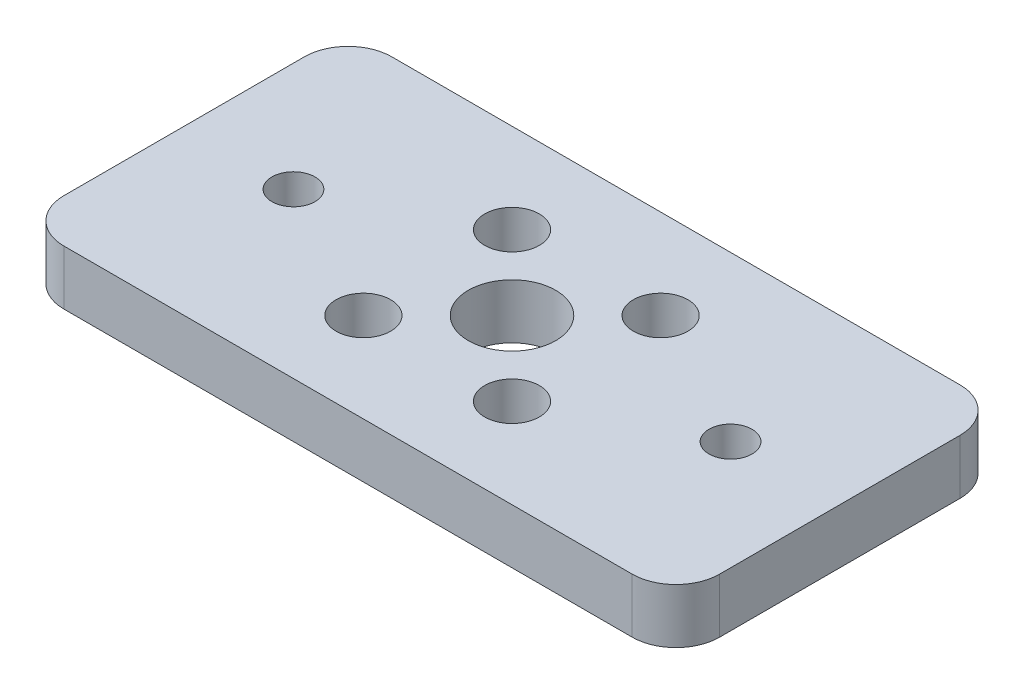
ISO-10303-21;
HEADER;
FILE_DESCRIPTION(('STEP AP214'),'2;1');
FILE_NAME('part.step','',(''),(''),'','','');
FILE_SCHEMA(('AUTOMOTIVE_DESIGN { 1 0 10303 214 1 1 1 1 }'));
ENDSEC;
DATA;
#1=APPLICATION_CONTEXT('core data for automotive mechanical design processes');
#2=APPLICATION_PROTOCOL_DEFINITION('international standard','automotive_design',2000,#1);
#3=PRODUCT_CONTEXT('',#1,'mechanical');
#4=PRODUCT('Part','Part','',(#3));
#5=PRODUCT_RELATED_PRODUCT_CATEGORY('part','',(#4));
#6=PRODUCT_DEFINITION_FORMATION('','',#4);
#7=PRODUCT_DEFINITION_CONTEXT('part definition',#1,'design');
#8=PRODUCT_DEFINITION('design','',#6,#7);
#9=PRODUCT_DEFINITION_SHAPE('','',#8);
#10=(LENGTH_UNIT() NAMED_UNIT(*) SI_UNIT(.MILLI.,.METRE.));
#11=(NAMED_UNIT(*) PLANE_ANGLE_UNIT() SI_UNIT($,.RADIAN.));
#12=(NAMED_UNIT(*) SI_UNIT($,.STERADIAN.) SOLID_ANGLE_UNIT());
#13=UNCERTAINTY_MEASURE_WITH_UNIT(LENGTH_MEASURE(1.E-05),#10,'distance_accuracy_value','');
#14=(GEOMETRIC_REPRESENTATION_CONTEXT(3) GLOBAL_UNCERTAINTY_ASSIGNED_CONTEXT((#13)) GLOBAL_UNIT_ASSIGNED_CONTEXT((#10,
#11,#12)) REPRESENTATION_CONTEXT('',''));
#15=CARTESIAN_POINT('',(0.,0.,0.));
#16=DIRECTION('',(0.,0.,1.));
#17=DIRECTION('',(1.,0.,0.));
#18=AXIS2_PLACEMENT_3D('',#15,#16,#17);
#19=CARTESIAN_POINT('',(0.,3.175,0.));
#20=DIRECTION('',(0.,-1.,0.));
#21=DIRECTION('',(0.,0.,-1.));
#22=AXIS2_PLACEMENT_3D('',#19,#20,#21);
#23=PLANE('',#22);
#24=CARTESIAN_POINT('',(-12.7,3.175,0.));
#25=DIRECTION('',(0.,1.,0.));
#26=DIRECTION('',(0.,0.,1.));
#27=AXIS2_PLACEMENT_3D('',#24,#25,#26);
#28=CIRCLE('',#27,1.24999999999999);
#29=CARTESIAN_POINT('',(-12.7,3.175,1.24999999999999));
#30=VERTEX_POINT('',#29);
#31=EDGE_CURVE('E251',#30,#30,#28,.T.);
#32=ORIENTED_EDGE('',*,*,#31,.F.);
#33=EDGE_LOOP('',(#32));
#34=FACE_BOUND('',#33,.T.);
#35=CARTESIAN_POINT('',(12.7,3.175,0.));
#36=DIRECTION('',(0.,1.,0.));
#37=DIRECTION('',(0.,0.,1.));
#38=AXIS2_PLACEMENT_3D('',#35,#36,#37);
#39=CIRCLE('',#38,1.24999999999999);
#40=CARTESIAN_POINT('',(12.7,3.175,1.24999999999998));
#41=VERTEX_POINT('',#40);
#42=EDGE_CURVE('E243',#41,#41,#39,.T.);
#43=ORIENTED_EDGE('',*,*,#42,.F.);
#44=EDGE_LOOP('',(#43));
#45=FACE_BOUND('',#44,.T.);
#46=CARTESIAN_POINT('',(4.318,3.175,-4.318));
#47=DIRECTION('',(0.,1.,0.));
#48=DIRECTION('',(0.,0.,1.));
#49=AXIS2_PLACEMENT_3D('',#46,#47,#48);
#50=CIRCLE('',#49,1.5875);
#51=CARTESIAN_POINT('',(4.318,3.175,-2.7305));
#52=VERTEX_POINT('',#51);
#53=EDGE_CURVE('E212',#52,#52,#50,.T.);
#54=ORIENTED_EDGE('',*,*,#53,.F.);
#55=EDGE_LOOP('',(#54));
#56=FACE_BOUND('',#55,.T.);
#57=CARTESIAN_POINT('',(-4.318,3.175,4.318));
#58=DIRECTION('',(0.,1.,0.));
#59=DIRECTION('',(0.,0.,1.));
#60=AXIS2_PLACEMENT_3D('',#57,#58,#59);
#61=CIRCLE('',#60,1.5875);
#62=CARTESIAN_POINT('',(-4.318,3.175,5.9055));
#63=VERTEX_POINT('',#62);
#64=EDGE_CURVE('E220',#63,#63,#61,.T.);
#65=ORIENTED_EDGE('',*,*,#64,.F.);
#66=EDGE_LOOP('',(#65));
#67=FACE_BOUND('',#66,.T.);
#68=CARTESIAN_POINT('',(4.318,3.175,4.318));
#69=DIRECTION('',(0.,1.,0.));
#70=DIRECTION('',(0.,0.,1.));
#71=AXIS2_PLACEMENT_3D('',#68,#69,#70);
#72=CIRCLE('',#71,1.5875);
#73=CARTESIAN_POINT('',(4.318,3.175,5.9055));
#74=VERTEX_POINT('',#73);
#75=EDGE_CURVE('E221',#74,#74,#72,.T.);
#76=ORIENTED_EDGE('',*,*,#75,.F.);
#77=EDGE_LOOP('',(#76));
#78=FACE_BOUND('',#77,.T.);
#79=CARTESIAN_POINT('',(-4.318,3.175,-4.318));
#80=DIRECTION('',(0.,1.,0.));
#81=DIRECTION('',(0.,0.,1.));
#82=AXIS2_PLACEMENT_3D('',#79,#80,#81);
#83=CIRCLE('',#82,1.5875);
#84=CARTESIAN_POINT('',(-4.318,3.175,-2.7305));
#85=VERTEX_POINT('',#84);
#86=EDGE_CURVE('E208',#85,#85,#83,.T.);
#87=ORIENTED_EDGE('',*,*,#86,.F.);
#88=EDGE_LOOP('',(#87));
#89=FACE_BOUND('',#88,.T.);
#90=DIRECTION('',(0.,0.,-1.));
#91=VECTOR('',#90,1.);
#92=CARTESIAN_POINT('',(19.05,3.175,9.525));
#93=LINE('',#92,#91);
#94=CARTESIAN_POINT('',(19.05,3.175,6.985));
#95=VERTEX_POINT('',#94);
#96=CARTESIAN_POINT('',(19.05,3.175,-6.98499999999999));
#97=VERTEX_POINT('',#96);
#98=EDGE_CURVE('E155',#95,#97,#93,.T.);
#99=ORIENTED_EDGE('',*,*,#98,.T.);
#100=CARTESIAN_POINT('',(16.51,3.175,-6.985));
#101=DIRECTION('',(0.,-1.,0.));
#102=DIRECTION('',(0.,0.,-1.));
#103=AXIS2_PLACEMENT_3D('',#100,#101,#102);
#104=CIRCLE('',#103,2.54);
#105=CARTESIAN_POINT('',(16.51,3.175,-9.525));
#106=VERTEX_POINT('',#105);
#107=EDGE_CURVE('E179',#97,#106,#104,.F.);
#108=ORIENTED_EDGE('',*,*,#107,.T.);
#109=DIRECTION('',(-1.,0.,0.));
#110=VECTOR('',#109,1.);
#111=CARTESIAN_POINT('',(-19.05,3.175,-9.525));
#112=LINE('',#111,#110);
#113=CARTESIAN_POINT('',(-16.51,3.175,-9.525));
#114=VERTEX_POINT('',#113);
#115=EDGE_CURVE('E132',#106,#114,#112,.T.);
#116=ORIENTED_EDGE('',*,*,#115,.T.);
#117=CARTESIAN_POINT('',(-16.51,3.175,-6.985));
#118=DIRECTION('',(0.,-1.,0.));
#119=DIRECTION('',(0.,0.,-1.));
#120=AXIS2_PLACEMENT_3D('',#117,#118,#119);
#121=CIRCLE('',#120,2.54);
#122=CARTESIAN_POINT('',(-19.05,3.175,-6.98499999999999));
#123=VERTEX_POINT('',#122);
#124=EDGE_CURVE('E176',#114,#123,#121,.F.);
#125=ORIENTED_EDGE('',*,*,#124,.T.);
#126=DIRECTION('',(0.,0.,1.));
#127=VECTOR('',#126,1.);
#128=CARTESIAN_POINT('',(-19.05,3.175,9.525));
#129=LINE('',#128,#127);
#130=CARTESIAN_POINT('',(-19.05,3.175,6.985));
#131=VERTEX_POINT('',#130);
#132=EDGE_CURVE('E191',#123,#131,#129,.T.);
#133=ORIENTED_EDGE('',*,*,#132,.T.);
#134=CARTESIAN_POINT('',(-16.51,3.175,6.985));
#135=DIRECTION('',(0.,-1.,0.));
#136=DIRECTION('',(0.,0.,-1.));
#137=AXIS2_PLACEMENT_3D('',#134,#135,#136);
#138=CIRCLE('',#137,2.54);
#139=CARTESIAN_POINT('',(-16.51,3.175,9.525));
#140=VERTEX_POINT('',#139);
#141=EDGE_CURVE('E66',#131,#140,#138,.F.);
#142=ORIENTED_EDGE('',*,*,#141,.T.);
#143=DIRECTION('',(1.,0.,0.));
#144=VECTOR('',#143,1.);
#145=CARTESIAN_POINT('',(-19.05,3.175,9.525));
#146=LINE('',#145,#144);
#147=CARTESIAN_POINT('',(16.51,3.175,9.525));
#148=VERTEX_POINT('',#147);
#149=EDGE_CURVE('E157',#140,#148,#146,.T.);
#150=ORIENTED_EDGE('',*,*,#149,.T.);
#151=CARTESIAN_POINT('',(16.51,3.175,6.985));
#152=DIRECTION('',(0.,-1.,0.));
#153=DIRECTION('',(0.,0.,-1.));
#154=AXIS2_PLACEMENT_3D('',#151,#152,#153);
#155=CIRCLE('',#154,2.54);
#156=EDGE_CURVE('E171',#148,#95,#155,.F.);
#157=ORIENTED_EDGE('',*,*,#156,.T.);
#158=EDGE_LOOP('',(#99,#108,#116,#125,#133,#142,#150,#157));
#159=FACE_BOUND('',#158,.T.);
#160=CARTESIAN_POINT('',(0.,3.175,0.));
#161=DIRECTION('',(0.,1.,0.));
#162=DIRECTION('',(0.,0.,1.));
#163=AXIS2_PLACEMENT_3D('',#160,#161,#162);
#164=CIRCLE('',#163,2.54);
#165=CARTESIAN_POINT('',(0.,3.175,2.54));
#166=VERTEX_POINT('',#165);
#167=EDGE_CURVE('E149',#166,#166,#164,.T.);
#168=ORIENTED_EDGE('',*,*,#167,.F.);
#169=EDGE_LOOP('',(#168));
#170=FACE_BOUND('',#169,.T.);
#171=ADVANCED_FACE('F44',(#34,#45,#56,#67,#78,#89,#159,#170),#23,.F.);
#172=CARTESIAN_POINT('',(0.,0.,0.));
#173=DIRECTION('',(0.,-1.,0.));
#174=DIRECTION('',(0.,0.,-1.));
#175=AXIS2_PLACEMENT_3D('',#172,#173,#174);
#176=PLANE('',#175);
#177=CARTESIAN_POINT('',(-12.7,0.,0.));
#178=DIRECTION('',(0.,1.,0.));
#179=DIRECTION('',(0.,0.,1.));
#180=AXIS2_PLACEMENT_3D('',#177,#178,#179);
#181=CIRCLE('',#180,1.25);
#182=CARTESIAN_POINT('',(-12.7,0.,1.25));
#183=VERTEX_POINT('',#182);
#184=EDGE_CURVE('E247',#183,#183,#181,.T.);
#185=ORIENTED_EDGE('',*,*,#184,.T.);
#186=EDGE_LOOP('',(#185));
#187=FACE_BOUND('',#186,.T.);
#188=CARTESIAN_POINT('',(12.7,0.,0.));
#189=DIRECTION('',(0.,1.,0.));
#190=DIRECTION('',(0.,0.,1.));
#191=AXIS2_PLACEMENT_3D('',#188,#189,#190);
#192=CIRCLE('',#191,1.25);
#193=CARTESIAN_POINT('',(12.7,0.,1.24999999999999));
#194=VERTEX_POINT('',#193);
#195=EDGE_CURVE('E236',#194,#194,#192,.T.);
#196=ORIENTED_EDGE('',*,*,#195,.T.);
#197=EDGE_LOOP('',(#196));
#198=FACE_BOUND('',#197,.T.);
#199=CARTESIAN_POINT('',(4.318,0.,-4.318));
#200=DIRECTION('',(0.,1.,0.));
#201=DIRECTION('',(0.,0.,1.));
#202=AXIS2_PLACEMENT_3D('',#199,#200,#201);
#203=CIRCLE('',#202,1.5875);
#204=CARTESIAN_POINT('',(4.318,0.,-2.7305));
#205=VERTEX_POINT('',#204);
#206=EDGE_CURVE('E225',#205,#205,#203,.T.);
#207=ORIENTED_EDGE('',*,*,#206,.T.);
#208=EDGE_LOOP('',(#207));
#209=FACE_BOUND('',#208,.T.);
#210=CARTESIAN_POINT('',(-4.318,0.,4.318));
#211=DIRECTION('',(0.,1.,0.));
#212=DIRECTION('',(0.,0.,1.));
#213=AXIS2_PLACEMENT_3D('',#210,#211,#212);
#214=CIRCLE('',#213,1.5875);
#215=CARTESIAN_POINT('',(-4.318,0.,5.9055));
#216=VERTEX_POINT('',#215);
#217=EDGE_CURVE('E216',#216,#216,#214,.T.);
#218=ORIENTED_EDGE('',*,*,#217,.T.);
#219=EDGE_LOOP('',(#218));
#220=FACE_BOUND('',#219,.T.);
#221=CARTESIAN_POINT('',(4.318,0.,4.318));
#222=DIRECTION('',(0.,1.,0.));
#223=DIRECTION('',(0.,0.,1.));
#224=AXIS2_PLACEMENT_3D('',#221,#222,#223);
#225=CIRCLE('',#224,1.5875);
#226=CARTESIAN_POINT('',(4.318,0.,5.9055));
#227=VERTEX_POINT('',#226);
#228=EDGE_CURVE('E232',#227,#227,#225,.T.);
#229=ORIENTED_EDGE('',*,*,#228,.T.);
#230=EDGE_LOOP('',(#229));
#231=FACE_BOUND('',#230,.T.);
#232=CARTESIAN_POINT('',(-4.318,0.,-4.318));
#233=DIRECTION('',(0.,1.,0.));
#234=DIRECTION('',(0.,0.,1.));
#235=AXIS2_PLACEMENT_3D('',#232,#233,#234);
#236=CIRCLE('',#235,1.5875);
#237=CARTESIAN_POINT('',(-4.318,0.,-2.7305));
#238=VERTEX_POINT('',#237);
#239=EDGE_CURVE('E204',#238,#238,#236,.T.);
#240=ORIENTED_EDGE('',*,*,#239,.T.);
#241=EDGE_LOOP('',(#240));
#242=FACE_BOUND('',#241,.T.);
#243=DIRECTION('',(-1.,0.,0.));
#244=VECTOR('',#243,1.);
#245=CARTESIAN_POINT('',(-19.05,0.,-9.525));
#246=LINE('',#245,#244);
#247=CARTESIAN_POINT('',(16.51,0.,-9.525));
#248=VERTEX_POINT('',#247);
#249=CARTESIAN_POINT('',(-16.51,0.,-9.525));
#250=VERTEX_POINT('',#249);
#251=EDGE_CURVE('E129',#248,#250,#246,.T.);
#252=ORIENTED_EDGE('',*,*,#251,.F.);
#253=CARTESIAN_POINT('',(16.51,0.,-6.985));
#254=DIRECTION('',(0.,-1.,0.));
#255=DIRECTION('',(0.,0.,-1.));
#256=AXIS2_PLACEMENT_3D('',#253,#254,#255);
#257=CIRCLE('',#256,2.54);
#258=CARTESIAN_POINT('',(19.05,0.,-6.98499999999999));
#259=VERTEX_POINT('',#258);
#260=EDGE_CURVE('E111',#248,#259,#257,.T.);
#261=ORIENTED_EDGE('',*,*,#260,.T.);
#262=DIRECTION('',(0.,0.,-1.));
#263=VECTOR('',#262,1.);
#264=CARTESIAN_POINT('',(19.05,0.,9.525));
#265=LINE('',#264,#263);
#266=CARTESIAN_POINT('',(19.05,0.,6.985));
#267=VERTEX_POINT('',#266);
#268=EDGE_CURVE('E142',#267,#259,#265,.T.);
#269=ORIENTED_EDGE('',*,*,#268,.F.);
#270=CARTESIAN_POINT('',(16.51,0.,6.985));
#271=DIRECTION('',(0.,-1.,0.));
#272=DIRECTION('',(0.,0.,-1.));
#273=AXIS2_PLACEMENT_3D('',#270,#271,#272);
#274=CIRCLE('',#273,2.54);
#275=CARTESIAN_POINT('',(16.51,0.,9.525));
#276=VERTEX_POINT('',#275);
#277=EDGE_CURVE('E134',#267,#276,#274,.T.);
#278=ORIENTED_EDGE('',*,*,#277,.T.);
#279=DIRECTION('',(1.,0.,0.));
#280=VECTOR('',#279,1.);
#281=CARTESIAN_POINT('',(-19.05,0.,9.525));
#282=LINE('',#281,#280);
#283=CARTESIAN_POINT('',(-16.51,0.,9.525));
#284=VERTEX_POINT('',#283);
#285=EDGE_CURVE('E147',#284,#276,#282,.T.);
#286=ORIENTED_EDGE('',*,*,#285,.F.);
#287=CARTESIAN_POINT('',(-16.51,0.,6.985));
#288=DIRECTION('',(0.,-1.,0.));
#289=DIRECTION('',(0.,0.,-1.));
#290=AXIS2_PLACEMENT_3D('',#287,#288,#289);
#291=CIRCLE('',#290,2.54);
#292=CARTESIAN_POINT('',(-19.05,0.,6.985));
#293=VERTEX_POINT('',#292);
#294=EDGE_CURVE('E161',#284,#293,#291,.T.);
#295=ORIENTED_EDGE('',*,*,#294,.T.);
#296=DIRECTION('',(0.,0.,1.));
#297=VECTOR('',#296,1.);
#298=CARTESIAN_POINT('',(-19.05,0.,9.525));
#299=LINE('',#298,#297);
#300=CARTESIAN_POINT('',(-19.05,0.,-6.98499999999999));
#301=VERTEX_POINT('',#300);
#302=EDGE_CURVE('E141',#301,#293,#299,.T.);
#303=ORIENTED_EDGE('',*,*,#302,.F.);
#304=CARTESIAN_POINT('',(-16.51,0.,-6.985));
#305=DIRECTION('',(0.,-1.,0.));
#306=DIRECTION('',(0.,0.,-1.));
#307=AXIS2_PLACEMENT_3D('',#304,#305,#306);
#308=CIRCLE('',#307,2.54);
#309=EDGE_CURVE('E123',#301,#250,#308,.T.);
#310=ORIENTED_EDGE('',*,*,#309,.T.);
#311=EDGE_LOOP('',(#252,#261,#269,#278,#286,#295,#303,#310));
#312=FACE_BOUND('',#311,.T.);
#313=CARTESIAN_POINT('',(0.,0.,0.));
#314=DIRECTION('',(0.,1.,0.));
#315=DIRECTION('',(0.,0.,1.));
#316=AXIS2_PLACEMENT_3D('',#313,#314,#315);
#317=CIRCLE('',#316,2.54);
#318=CARTESIAN_POINT('',(0.,0.,2.54));
#319=VERTEX_POINT('',#318);
#320=EDGE_CURVE('E200',#319,#319,#317,.T.);
#321=ORIENTED_EDGE('',*,*,#320,.T.);
#322=EDGE_LOOP('',(#321));
#323=FACE_BOUND('',#322,.T.);
#324=ADVANCED_FACE('F137',(#187,#198,#209,#220,#231,#242,#312,#323),#176,.T.);
#325=CARTESIAN_POINT('',(19.05,3.175,9.525));
#326=DIRECTION('',(-1.,0.,0.));
#327=DIRECTION('',(0.,0.,1.));
#328=AXIS2_PLACEMENT_3D('',#325,#326,#327);
#329=PLANE('',#328);
#330=ORIENTED_EDGE('',*,*,#268,.T.);
#331=DIRECTION('',(0.,-1.,0.));
#332=VECTOR('',#331,1.);
#333=CARTESIAN_POINT('',(19.05,3.175,-6.985));
#334=LINE('',#333,#332);
#335=EDGE_CURVE('E116',#259,#97,#334,.F.);
#336=ORIENTED_EDGE('',*,*,#335,.T.);
#337=ORIENTED_EDGE('',*,*,#98,.F.);
#338=DIRECTION('',(0.,-1.,0.));
#339=VECTOR('',#338,1.);
#340=CARTESIAN_POINT('',(19.05,3.175,6.985));
#341=LINE('',#340,#339);
#342=EDGE_CURVE('E122',#95,#267,#341,.T.);
#343=ORIENTED_EDGE('',*,*,#342,.T.);
#344=EDGE_LOOP('',(#330,#336,#337,#343));
#345=FACE_BOUND('',#344,.T.);
#346=ADVANCED_FACE('F281',(#345),#329,.F.);
#347=CARTESIAN_POINT('',(-19.05,3.175,-9.525));
#348=DIRECTION('',(0.,0.,1.));
#349=DIRECTION('',(1.,0.,0.));
#350=AXIS2_PLACEMENT_3D('',#347,#348,#349);
#351=PLANE('',#350);
#352=ORIENTED_EDGE('',*,*,#115,.F.);
#353=DIRECTION('',(0.,-1.,0.));
#354=VECTOR('',#353,1.);
#355=CARTESIAN_POINT('',(16.51,3.175,-9.525));
#356=LINE('',#355,#354);
#357=EDGE_CURVE('E115',#106,#248,#356,.T.);
#358=ORIENTED_EDGE('',*,*,#357,.T.);
#359=ORIENTED_EDGE('',*,*,#251,.T.);
#360=DIRECTION('',(0.,-1.,0.));
#361=VECTOR('',#360,1.);
#362=CARTESIAN_POINT('',(-16.51,3.175,-9.525));
#363=LINE('',#362,#361);
#364=EDGE_CURVE('E135',#250,#114,#363,.F.);
#365=ORIENTED_EDGE('',*,*,#364,.T.);
#366=EDGE_LOOP('',(#352,#358,#359,#365));
#367=FACE_BOUND('',#366,.T.);
#368=ADVANCED_FACE('F128',(#367),#351,.F.);
#369=CARTESIAN_POINT('',(-19.05,3.175,9.525));
#370=DIRECTION('',(1.,0.,0.));
#371=DIRECTION('',(0.,0.,-1.));
#372=AXIS2_PLACEMENT_3D('',#369,#370,#371);
#373=PLANE('',#372);
#374=ORIENTED_EDGE('',*,*,#132,.F.);
#375=DIRECTION('',(0.,-1.,0.));
#376=VECTOR('',#375,1.);
#377=CARTESIAN_POINT('',(-19.05,3.175,-6.985));
#378=LINE('',#377,#376);
#379=EDGE_CURVE('E185',#123,#301,#378,.T.);
#380=ORIENTED_EDGE('',*,*,#379,.T.);
#381=ORIENTED_EDGE('',*,*,#302,.T.);
#382=DIRECTION('',(0.,-1.,0.));
#383=VECTOR('',#382,1.);
#384=CARTESIAN_POINT('',(-19.05,3.175,6.985));
#385=LINE('',#384,#383);
#386=EDGE_CURVE('E182',#293,#131,#385,.F.);
#387=ORIENTED_EDGE('',*,*,#386,.T.);
#388=EDGE_LOOP('',(#374,#380,#381,#387));
#389=FACE_BOUND('',#388,.T.);
#390=ADVANCED_FACE('F293',(#389),#373,.F.);
#391=CARTESIAN_POINT('',(-19.05,3.175,9.525));
#392=DIRECTION('',(0.,0.,-1.));
#393=DIRECTION('',(-1.,0.,0.));
#394=AXIS2_PLACEMENT_3D('',#391,#392,#393);
#395=PLANE('',#394);
#396=ORIENTED_EDGE('',*,*,#149,.F.);
#397=DIRECTION('',(0.,-1.,0.));
#398=VECTOR('',#397,1.);
#399=CARTESIAN_POINT('',(-16.51,3.175,9.525));
#400=LINE('',#399,#398);
#401=EDGE_CURVE('E11',#140,#284,#400,.T.);
#402=ORIENTED_EDGE('',*,*,#401,.T.);
#403=ORIENTED_EDGE('',*,*,#285,.T.);
#404=DIRECTION('',(0.,-1.,0.));
#405=VECTOR('',#404,1.);
#406=CARTESIAN_POINT('',(16.51,3.175,9.525));
#407=LINE('',#406,#405);
#408=EDGE_CURVE('E53',#276,#148,#407,.F.);
#409=ORIENTED_EDGE('',*,*,#408,.T.);
#410=EDGE_LOOP('',(#396,#402,#403,#409));
#411=FACE_BOUND('',#410,.T.);
#412=ADVANCED_FACE('F277',(#411),#395,.F.);
#413=CARTESIAN_POINT('',(0.,3.175,0.));
#414=DIRECTION('',(0.,-1.,0.));
#415=DIRECTION('',(0.,0.,-1.));
#416=AXIS2_PLACEMENT_3D('',#413,#414,#415);
#417=CYLINDRICAL_SURFACE('',#416,2.54);
#418=ORIENTED_EDGE('',*,*,#167,.T.);
#419=EDGE_LOOP('',(#418));
#420=FACE_BOUND('',#419,.T.);
#421=ORIENTED_EDGE('',*,*,#320,.F.);
#422=EDGE_LOOP('',(#421));
#423=FACE_BOUND('',#422,.T.);
#424=ADVANCED_FACE('F273',(#420,#423),#417,.F.);
#425=CARTESIAN_POINT('',(-4.318,0.,-4.318));
#426=DIRECTION('',(0.,1.,0.));
#427=DIRECTION('',(0.,0.,1.));
#428=AXIS2_PLACEMENT_3D('',#425,#426,#427);
#429=CYLINDRICAL_SURFACE('',#428,1.5875);
#430=ORIENTED_EDGE('',*,*,#239,.F.);
#431=EDGE_LOOP('',(#430));
#432=FACE_BOUND('',#431,.T.);
#433=ORIENTED_EDGE('',*,*,#86,.T.);
#434=EDGE_LOOP('',(#433));
#435=FACE_BOUND('',#434,.T.);
#436=ADVANCED_FACE('F276',(#432,#435),#429,.F.);
#437=CARTESIAN_POINT('',(4.318,0.,4.318));
#438=DIRECTION('',(0.,1.,0.));
#439=DIRECTION('',(0.,0.,1.));
#440=AXIS2_PLACEMENT_3D('',#437,#438,#439);
#441=CYLINDRICAL_SURFACE('',#440,1.5875);
#442=ORIENTED_EDGE('',*,*,#228,.F.);
#443=EDGE_LOOP('',(#442));
#444=FACE_BOUND('',#443,.T.);
#445=ORIENTED_EDGE('',*,*,#75,.T.);
#446=EDGE_LOOP('',(#445));
#447=FACE_BOUND('',#446,.T.);
#448=ADVANCED_FACE('F377',(#444,#447),#441,.F.);
#449=CARTESIAN_POINT('',(-4.318,0.,4.318));
#450=DIRECTION('',(0.,1.,0.));
#451=DIRECTION('',(0.,0.,1.));
#452=AXIS2_PLACEMENT_3D('',#449,#450,#451);
#453=CYLINDRICAL_SURFACE('',#452,1.5875);
#454=ORIENTED_EDGE('',*,*,#217,.F.);
#455=EDGE_LOOP('',(#454));
#456=FACE_BOUND('',#455,.T.);
#457=ORIENTED_EDGE('',*,*,#64,.T.);
#458=EDGE_LOOP('',(#457));
#459=FACE_BOUND('',#458,.T.);
#460=ADVANCED_FACE('F367',(#456,#459),#453,.F.);
#461=CARTESIAN_POINT('',(4.318,0.,-4.318));
#462=DIRECTION('',(0.,1.,0.));
#463=DIRECTION('',(0.,0.,1.));
#464=AXIS2_PLACEMENT_3D('',#461,#462,#463);
#465=CYLINDRICAL_SURFACE('',#464,1.5875);
#466=ORIENTED_EDGE('',*,*,#206,.F.);
#467=EDGE_LOOP('',(#466));
#468=FACE_BOUND('',#467,.T.);
#469=ORIENTED_EDGE('',*,*,#53,.T.);
#470=EDGE_LOOP('',(#469));
#471=FACE_BOUND('',#470,.T.);
#472=ADVANCED_FACE('F357',(#468,#471),#465,.F.);
#473=CARTESIAN_POINT('',(12.7,3.175,0.));
#474=DIRECTION('',(0.,1.,0.));
#475=DIRECTION('',(0.,0.,1.));
#476=AXIS2_PLACEMENT_3D('',#473,#474,#475);
#477=CYLINDRICAL_SURFACE('',#476,1.24999999999999);
#478=ORIENTED_EDGE('',*,*,#195,.F.);
#479=EDGE_LOOP('',(#478));
#480=FACE_BOUND('',#479,.T.);
#481=ORIENTED_EDGE('',*,*,#42,.T.);
#482=EDGE_LOOP('',(#481));
#483=FACE_BOUND('',#482,.T.);
#484=ADVANCED_FACE('F347',(#480,#483),#477,.F.);
#485=CARTESIAN_POINT('',(-12.7,3.175,0.));
#486=DIRECTION('',(0.,1.,0.));
#487=DIRECTION('',(0.,0.,1.));
#488=AXIS2_PLACEMENT_3D('',#485,#486,#487);
#489=CYLINDRICAL_SURFACE('',#488,1.24999999999999);
#490=ORIENTED_EDGE('',*,*,#184,.F.);
#491=EDGE_LOOP('',(#490));
#492=FACE_BOUND('',#491,.T.);
#493=ORIENTED_EDGE('',*,*,#31,.T.);
#494=EDGE_LOOP('',(#493));
#495=FACE_BOUND('',#494,.T.);
#496=ADVANCED_FACE('F256',(#492,#495),#489,.F.);
#497=CARTESIAN_POINT('',(16.51,3.175,-6.985));
#498=DIRECTION('',(0.,-1.,0.));
#499=DIRECTION('',(0.,0.,-1.));
#500=AXIS2_PLACEMENT_3D('',#497,#498,#499);
#501=CYLINDRICAL_SURFACE('',#500,2.54);
#502=ORIENTED_EDGE('',*,*,#107,.F.);
#503=ORIENTED_EDGE('',*,*,#335,.F.);
#504=ORIENTED_EDGE('',*,*,#260,.F.);
#505=ORIENTED_EDGE('',*,*,#357,.F.);
#506=EDGE_LOOP('',(#502,#503,#504,#505));
#507=FACE_BOUND('',#506,.T.);
#508=ADVANCED_FACE('F114',(#507),#501,.T.);
#509=CARTESIAN_POINT('',(-16.51,3.175,-6.985));
#510=DIRECTION('',(0.,-1.,0.));
#511=DIRECTION('',(0.,0.,-1.));
#512=AXIS2_PLACEMENT_3D('',#509,#510,#511);
#513=CYLINDRICAL_SURFACE('',#512,2.54);
#514=ORIENTED_EDGE('',*,*,#124,.F.);
#515=ORIENTED_EDGE('',*,*,#364,.F.);
#516=ORIENTED_EDGE('',*,*,#309,.F.);
#517=ORIENTED_EDGE('',*,*,#379,.F.);
#518=EDGE_LOOP('',(#514,#515,#516,#517));
#519=FACE_BOUND('',#518,.T.);
#520=ADVANCED_FACE('F301',(#519),#513,.T.);
#521=CARTESIAN_POINT('',(-16.51,3.175,6.985));
#522=DIRECTION('',(0.,-1.,0.));
#523=DIRECTION('',(0.,0.,-1.));
#524=AXIS2_PLACEMENT_3D('',#521,#522,#523);
#525=CYLINDRICAL_SURFACE('',#524,2.54);
#526=ORIENTED_EDGE('',*,*,#141,.F.);
#527=ORIENTED_EDGE('',*,*,#386,.F.);
#528=ORIENTED_EDGE('',*,*,#294,.F.);
#529=ORIENTED_EDGE('',*,*,#401,.F.);
#530=EDGE_LOOP('',(#526,#527,#528,#529));
#531=FACE_BOUND('',#530,.T.);
#532=ADVANCED_FACE('F303',(#531),#525,.T.);
#533=CARTESIAN_POINT('',(16.51,3.175,6.985));
#534=DIRECTION('',(0.,-1.,0.));
#535=DIRECTION('',(0.,0.,-1.));
#536=AXIS2_PLACEMENT_3D('',#533,#534,#535);
#537=CYLINDRICAL_SURFACE('',#536,2.54);
#538=ORIENTED_EDGE('',*,*,#156,.F.);
#539=ORIENTED_EDGE('',*,*,#408,.F.);
#540=ORIENTED_EDGE('',*,*,#277,.F.);
#541=ORIENTED_EDGE('',*,*,#342,.F.);
#542=EDGE_LOOP('',(#538,#539,#540,#541));
#543=FACE_BOUND('',#542,.T.);
#544=ADVANCED_FACE('F46',(#543),#537,.T.);
#545=CLOSED_SHELL('',(#171,#324,#346,#368,#390,#412,#424,#436,#448,#460,#472,#484,#496,#508,
#520,#532,#544));
#546=MANIFOLD_SOLID_BREP('B2',#545);
#547=ADVANCED_BREP_SHAPE_REPRESENTATION('',(#18,#546),#14);
#548=SHAPE_DEFINITION_REPRESENTATION(#9,#547);
ENDSEC;
END-ISO-10303-21;
